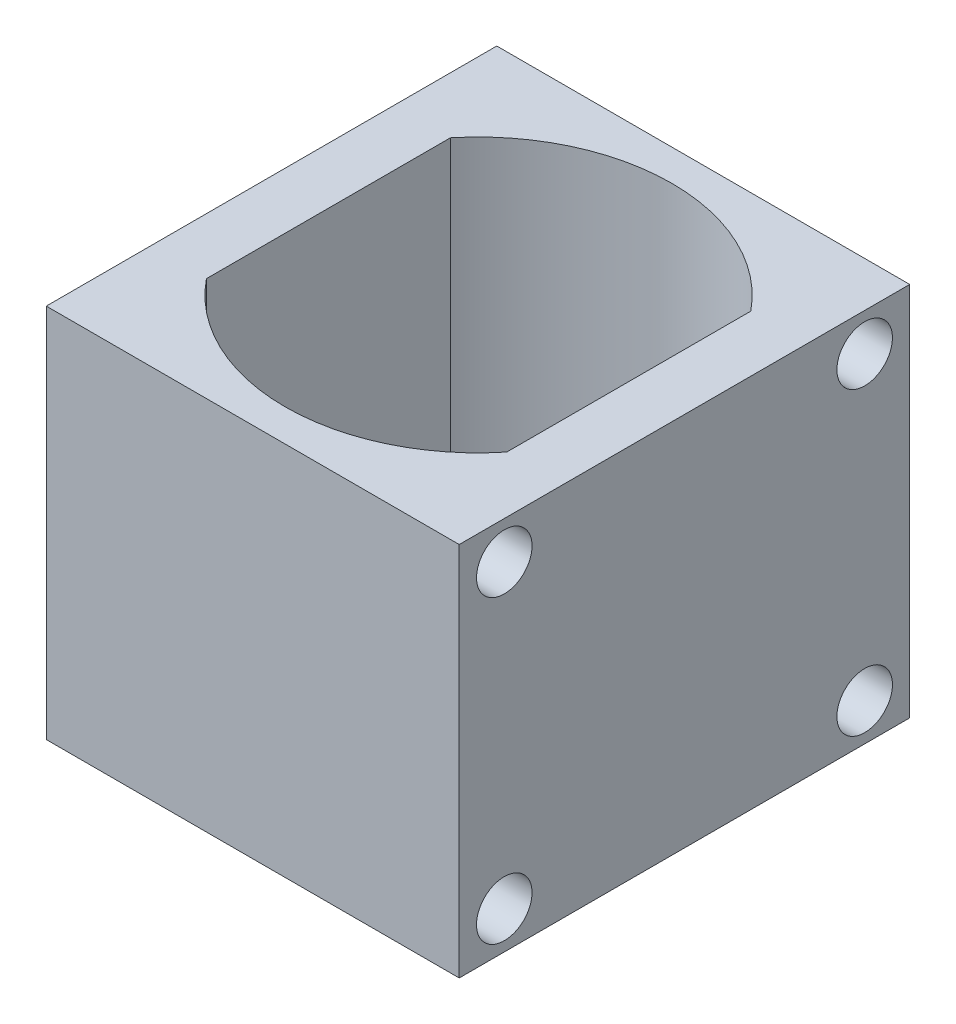
ISO-10303-21;
HEADER;
FILE_DESCRIPTION(('STEP AP214'),'2;1');
FILE_NAME('part.step','',(''),(''),'','','');
FILE_SCHEMA(('AUTOMOTIVE_DESIGN { 1 0 10303 214 1 1 1 1 }'));
ENDSEC;
DATA;
#1=APPLICATION_CONTEXT('core data for automotive mechanical design processes');
#2=APPLICATION_PROTOCOL_DEFINITION('international standard','automotive_design',2000,#1);
#3=PRODUCT_CONTEXT('',#1,'mechanical');
#4=PRODUCT('Part','Part','',(#3));
#5=PRODUCT_RELATED_PRODUCT_CATEGORY('part','',(#4));
#6=PRODUCT_DEFINITION_FORMATION('','',#4);
#7=PRODUCT_DEFINITION_CONTEXT('part definition',#1,'design');
#8=PRODUCT_DEFINITION('design','',#6,#7);
#9=PRODUCT_DEFINITION_SHAPE('','',#8);
#10=(LENGTH_UNIT() NAMED_UNIT(*) SI_UNIT(.MILLI.,.METRE.));
#11=(NAMED_UNIT(*) PLANE_ANGLE_UNIT() SI_UNIT($,.RADIAN.));
#12=(NAMED_UNIT(*) SI_UNIT($,.STERADIAN.) SOLID_ANGLE_UNIT());
#13=UNCERTAINTY_MEASURE_WITH_UNIT(LENGTH_MEASURE(1.E-05),#10,'distance_accuracy_value','');
#14=(GEOMETRIC_REPRESENTATION_CONTEXT(3) GLOBAL_UNCERTAINTY_ASSIGNED_CONTEXT((#13)) GLOBAL_UNIT_ASSIGNED_CONTEXT((#10,
#11,#12)) REPRESENTATION_CONTEXT('',''));
#15=CARTESIAN_POINT('',(0.,0.,0.));
#16=DIRECTION('',(0.,0.,1.));
#17=DIRECTION('',(1.,0.,0.));
#18=AXIS2_PLACEMENT_3D('',#15,#16,#17);
#19=CARTESIAN_POINT('',(0.,20.,0.));
#20=DIRECTION('',(0.,-1.,0.));
#21=DIRECTION('',(0.,0.,-1.));
#22=AXIS2_PLACEMENT_3D('',#19,#20,#21);
#23=PLANE('',#22);
#24=DIRECTION('',(0.,0.,1.));
#25=VECTOR('',#24,1.);
#26=CARTESIAN_POINT('',(-11.,20.,12.));
#27=LINE('',#26,#25);
#28=CARTESIAN_POINT('',(-11.,20.,-12.));
#29=VERTEX_POINT('',#28);
#30=CARTESIAN_POINT('',(-11.,20.,12.));
#31=VERTEX_POINT('',#30);
#32=EDGE_CURVE('E159',#29,#31,#27,.T.);
#33=ORIENTED_EDGE('',*,*,#32,.T.);
#34=DIRECTION('',(1.,0.,0.));
#35=VECTOR('',#34,1.);
#36=CARTESIAN_POINT('',(11.,20.,12.));
#37=LINE('',#36,#35);
#38=CARTESIAN_POINT('',(11.,20.,12.));
#39=VERTEX_POINT('',#38);
#40=EDGE_CURVE('E163',#31,#39,#37,.T.);
#41=ORIENTED_EDGE('',*,*,#40,.T.);
#42=DIRECTION('',(0.,0.,-1.));
#43=VECTOR('',#42,1.);
#44=CARTESIAN_POINT('',(11.,20.,-12.));
#45=LINE('',#44,#43);
#46=CARTESIAN_POINT('',(11.,20.,-12.));
#47=VERTEX_POINT('',#46);
#48=EDGE_CURVE('E167',#39,#47,#45,.T.);
#49=ORIENTED_EDGE('',*,*,#48,.T.);
#50=DIRECTION('',(-1.,0.,0.));
#51=VECTOR('',#50,1.);
#52=CARTESIAN_POINT('',(-11.,20.,-12.));
#53=LINE('',#52,#51);
#54=EDGE_CURVE('E170',#47,#29,#53,.T.);
#55=ORIENTED_EDGE('',*,*,#54,.T.);
#56=EDGE_LOOP('',(#33,#41,#49,#55));
#57=FACE_BOUND('',#56,.T.);
#58=CARTESIAN_POINT('',(0.,20.,0.));
#59=DIRECTION('',(0.,1.,0.));
#60=DIRECTION('',(0.,0.,-1.));
#61=AXIS2_PLACEMENT_3D('',#58,#59,#60);
#62=CIRCLE('',#61,10.3282894508827);
#63=CARTESIAN_POINT('',(7.99999999999999,20.,-6.53250051520967));
#64=VERTEX_POINT('',#63);
#65=CARTESIAN_POINT('',(-8.,20.,-6.53250051520967));
#66=VERTEX_POINT('',#65);
#67=EDGE_CURVE('E109',#64,#66,#62,.T.);
#68=ORIENTED_EDGE('',*,*,#67,.F.);
#69=DIRECTION('',(0.,0.,-1.));
#70=VECTOR('',#69,1.);
#71=CARTESIAN_POINT('',(7.99999999999999,20.,-6.53250051520967));
#72=LINE('',#71,#70);
#73=CARTESIAN_POINT('',(7.99999999999999,20.,6.46749948479033));
#74=VERTEX_POINT('',#73);
#75=EDGE_CURVE('E135',#74,#64,#72,.T.);
#76=ORIENTED_EDGE('',*,*,#75,.F.);
#77=CARTESIAN_POINT('',(0.,20.,0.));
#78=DIRECTION('',(0.,1.,0.));
#79=DIRECTION('',(0.,0.,1.));
#80=AXIS2_PLACEMENT_3D('',#77,#78,#79);
#81=CIRCLE('',#80,10.2873004032041);
#82=CARTESIAN_POINT('',(-8.,20.,6.46749948479033));
#83=VERTEX_POINT('',#82);
#84=EDGE_CURVE('E131',#83,#74,#81,.T.);
#85=ORIENTED_EDGE('',*,*,#84,.F.);
#86=DIRECTION('',(0.,0.,1.));
#87=VECTOR('',#86,1.);
#88=CARTESIAN_POINT('',(-8.,20.,-6.53250051520967));
#89=LINE('',#88,#87);
#90=EDGE_CURVE('E118',#66,#83,#89,.T.);
#91=ORIENTED_EDGE('',*,*,#90,.F.);
#92=EDGE_LOOP('',(#68,#76,#85,#91));
#93=FACE_BOUND('',#92,.T.);
#94=ADVANCED_FACE('F43',(#57,#93),#23,.F.);
#95=CARTESIAN_POINT('',(0.,0.,0.));
#96=DIRECTION('',(0.,-1.,0.));
#97=DIRECTION('',(0.,0.,-1.));
#98=AXIS2_PLACEMENT_3D('',#95,#96,#97);
#99=PLANE('',#98);
#100=DIRECTION('',(1.,0.,0.));
#101=VECTOR('',#100,1.);
#102=CARTESIAN_POINT('',(11.,0.,12.));
#103=LINE('',#102,#101);
#104=CARTESIAN_POINT('',(-11.,0.,12.));
#105=VERTEX_POINT('',#104);
#106=CARTESIAN_POINT('',(11.,0.,12.));
#107=VERTEX_POINT('',#106);
#108=EDGE_CURVE('E127',#105,#107,#103,.T.);
#109=ORIENTED_EDGE('',*,*,#108,.F.);
#110=DIRECTION('',(0.,0.,1.));
#111=VECTOR('',#110,1.);
#112=CARTESIAN_POINT('',(-11.,0.,0.));
#113=LINE('',#112,#111);
#114=CARTESIAN_POINT('',(-11.,0.,-12.));
#115=VERTEX_POINT('',#114);
#116=EDGE_CURVE('E164',#115,#105,#113,.T.);
#117=ORIENTED_EDGE('',*,*,#116,.F.);
#118=DIRECTION('',(-1.,0.,0.));
#119=VECTOR('',#118,1.);
#120=CARTESIAN_POINT('',(-11.,0.,-12.));
#121=LINE('',#120,#119);
#122=CARTESIAN_POINT('',(11.,0.,-12.));
#123=VERTEX_POINT('',#122);
#124=EDGE_CURVE('E180',#123,#115,#121,.T.);
#125=ORIENTED_EDGE('',*,*,#124,.F.);
#126=DIRECTION('',(0.,0.,-1.));
#127=VECTOR('',#126,1.);
#128=CARTESIAN_POINT('',(11.,0.,-12.));
#129=LINE('',#128,#127);
#130=EDGE_CURVE('E177',#107,#123,#129,.T.);
#131=ORIENTED_EDGE('',*,*,#130,.F.);
#132=EDGE_LOOP('',(#109,#117,#125,#131));
#133=FACE_BOUND('',#132,.T.);
#134=DIRECTION('',(0.,0.,-1.));
#135=VECTOR('',#134,1.);
#136=CARTESIAN_POINT('',(7.99999999999999,0.,-6.53250051520967));
#137=LINE('',#136,#135);
#138=CARTESIAN_POINT('',(7.99999999999999,0.,6.46749948479033));
#139=VERTEX_POINT('',#138);
#140=CARTESIAN_POINT('',(7.99999999999999,0.,-6.53250051520967));
#141=VERTEX_POINT('',#140);
#142=EDGE_CURVE('E119',#139,#141,#137,.T.);
#143=ORIENTED_EDGE('',*,*,#142,.T.);
#144=CARTESIAN_POINT('',(0.,0.,0.));
#145=DIRECTION('',(0.,1.,0.));
#146=DIRECTION('',(0.,0.,-1.));
#147=AXIS2_PLACEMENT_3D('',#144,#145,#146);
#148=CIRCLE('',#147,10.3282894508827);
#149=CARTESIAN_POINT('',(-8.,0.,-6.53250051520967));
#150=VERTEX_POINT('',#149);
#151=EDGE_CURVE('E67',#141,#150,#148,.T.);
#152=ORIENTED_EDGE('',*,*,#151,.T.);
#153=DIRECTION('',(0.,0.,1.));
#154=VECTOR('',#153,1.);
#155=CARTESIAN_POINT('',(-8.,0.,-6.53250051520967));
#156=LINE('',#155,#154);
#157=CARTESIAN_POINT('',(-8.,0.,6.46749948479033));
#158=VERTEX_POINT('',#157);
#159=EDGE_CURVE('E125',#150,#158,#156,.T.);
#160=ORIENTED_EDGE('',*,*,#159,.T.);
#161=CARTESIAN_POINT('',(0.,0.,0.));
#162=DIRECTION('',(0.,1.,0.));
#163=DIRECTION('',(0.,0.,1.));
#164=AXIS2_PLACEMENT_3D('',#161,#162,#163);
#165=CIRCLE('',#164,10.2873004032041);
#166=EDGE_CURVE('E146',#158,#139,#165,.T.);
#167=ORIENTED_EDGE('',*,*,#166,.T.);
#168=EDGE_LOOP('',(#143,#152,#160,#167));
#169=FACE_BOUND('',#168,.T.);
#170=ADVANCED_FACE('F203',(#133,#169),#99,.T.);
#171=CARTESIAN_POINT('',(11.,20.,12.));
#172=DIRECTION('',(0.,0.,-1.));
#173=DIRECTION('',(-1.,0.,0.));
#174=AXIS2_PLACEMENT_3D('',#171,#172,#173);
#175=PLANE('',#174);
#176=ORIENTED_EDGE('',*,*,#108,.T.);
#177=DIRECTION('',(0.,-1.,0.));
#178=VECTOR('',#177,1.);
#179=CARTESIAN_POINT('',(11.,20.,12.));
#180=LINE('',#179,#178);
#181=EDGE_CURVE('E52',#39,#107,#180,.T.);
#182=ORIENTED_EDGE('',*,*,#181,.F.);
#183=ORIENTED_EDGE('',*,*,#40,.F.);
#184=DIRECTION('',(0.,-1.,0.));
#185=VECTOR('',#184,1.);
#186=CARTESIAN_POINT('',(-11.,20.,12.));
#187=LINE('',#186,#185);
#188=EDGE_CURVE('E11',#31,#105,#187,.T.);
#189=ORIENTED_EDGE('',*,*,#188,.T.);
#190=EDGE_LOOP('',(#176,#182,#183,#189));
#191=FACE_BOUND('',#190,.T.);
#192=ADVANCED_FACE('F45',(#191),#175,.F.);
#193=CARTESIAN_POINT('',(11.,20.,-12.));
#194=DIRECTION('',(-1.,0.,0.));
#195=DIRECTION('',(0.,0.,1.));
#196=AXIS2_PLACEMENT_3D('',#193,#194,#195);
#197=PLANE('',#196);
#198=CARTESIAN_POINT('',(11.,2.,9.6));
#199=DIRECTION('',(1.,0.,0.));
#200=DIRECTION('',(0.,0.,1.));
#201=AXIS2_PLACEMENT_3D('',#198,#199,#200);
#202=CIRCLE('',#201,1.48);
#203=CARTESIAN_POINT('',(11.,2.,11.08));
#204=VERTEX_POINT('',#203);
#205=EDGE_CURVE('E419',#204,#204,#202,.T.);
#206=ORIENTED_EDGE('',*,*,#205,.F.);
#207=EDGE_LOOP('',(#206));
#208=FACE_BOUND('',#207,.T.);
#209=CARTESIAN_POINT('',(11.,2.,-9.6));
#210=DIRECTION('',(1.,0.,0.));
#211=DIRECTION('',(0.,0.,-1.));
#212=AXIS2_PLACEMENT_3D('',#209,#210,#211);
#213=CIRCLE('',#212,1.48);
#214=CARTESIAN_POINT('',(11.,2.,-11.08));
#215=VERTEX_POINT('',#214);
#216=EDGE_CURVE('E443',#215,#215,#213,.T.);
#217=ORIENTED_EDGE('',*,*,#216,.F.);
#218=EDGE_LOOP('',(#217));
#219=FACE_BOUND('',#218,.T.);
#220=CARTESIAN_POINT('',(11.,18.,-9.6));
#221=DIRECTION('',(1.,0.,0.));
#222=DIRECTION('',(0.,0.,1.));
#223=AXIS2_PLACEMENT_3D('',#220,#221,#222);
#224=CIRCLE('',#223,1.48);
#225=CARTESIAN_POINT('',(11.,18.,-8.12));
#226=VERTEX_POINT('',#225);
#227=EDGE_CURVE('E432',#226,#226,#224,.T.);
#228=ORIENTED_EDGE('',*,*,#227,.F.);
#229=EDGE_LOOP('',(#228));
#230=FACE_BOUND('',#229,.T.);
#231=CARTESIAN_POINT('',(11.,18.,9.6));
#232=DIRECTION('',(1.,0.,0.));
#233=DIRECTION('',(0.,0.,-1.));
#234=AXIS2_PLACEMENT_3D('',#231,#232,#233);
#235=CIRCLE('',#234,1.48);
#236=CARTESIAN_POINT('',(11.,18.,8.12));
#237=VERTEX_POINT('',#236);
#238=EDGE_CURVE('E429',#237,#237,#235,.T.);
#239=ORIENTED_EDGE('',*,*,#238,.F.);
#240=EDGE_LOOP('',(#239));
#241=FACE_BOUND('',#240,.T.);
#242=ORIENTED_EDGE('',*,*,#130,.T.);
#243=DIRECTION('',(0.,-1.,0.));
#244=VECTOR('',#243,1.);
#245=CARTESIAN_POINT('',(11.,20.,-12.));
#246=LINE('',#245,#244);
#247=EDGE_CURVE('E188',#47,#123,#246,.T.);
#248=ORIENTED_EDGE('',*,*,#247,.F.);
#249=ORIENTED_EDGE('',*,*,#48,.F.);
#250=ORIENTED_EDGE('',*,*,#181,.T.);
#251=EDGE_LOOP('',(#242,#248,#249,#250));
#252=FACE_BOUND('',#251,.T.);
#253=ADVANCED_FACE('F197',(#208,#219,#230,#241,#252),#197,.F.);
#254=CARTESIAN_POINT('',(-11.,20.,-12.));
#255=DIRECTION('',(0.,0.,1.));
#256=DIRECTION('',(1.,0.,0.));
#257=AXIS2_PLACEMENT_3D('',#254,#255,#256);
#258=PLANE('',#257);
#259=ORIENTED_EDGE('',*,*,#124,.T.);
#260=DIRECTION('',(0.,-1.,0.));
#261=VECTOR('',#260,1.);
#262=CARTESIAN_POINT('',(-11.,20.,-12.));
#263=LINE('',#262,#261);
#264=EDGE_CURVE('E174',#29,#115,#263,.T.);
#265=ORIENTED_EDGE('',*,*,#264,.F.);
#266=ORIENTED_EDGE('',*,*,#54,.F.);
#267=ORIENTED_EDGE('',*,*,#247,.T.);
#268=EDGE_LOOP('',(#259,#265,#266,#267));
#269=FACE_BOUND('',#268,.T.);
#270=ADVANCED_FACE('F208',(#269),#258,.F.);
#271=CARTESIAN_POINT('',(-11.,20.,0.));
#272=DIRECTION('',(1.,0.,0.));
#273=DIRECTION('',(0.,0.,-1.));
#274=AXIS2_PLACEMENT_3D('',#271,#272,#273);
#275=PLANE('',#274);
#276=ORIENTED_EDGE('',*,*,#116,.T.);
#277=ORIENTED_EDGE('',*,*,#188,.F.);
#278=ORIENTED_EDGE('',*,*,#32,.F.);
#279=ORIENTED_EDGE('',*,*,#264,.T.);
#280=EDGE_LOOP('',(#276,#277,#278,#279));
#281=FACE_BOUND('',#280,.T.);
#282=ADVANCED_FACE('F211',(#281),#275,.F.);
#283=CARTESIAN_POINT('',(0.,20.,0.));
#284=DIRECTION('',(0.,-1.,0.));
#285=DIRECTION('',(0.,0.,-1.));
#286=AXIS2_PLACEMENT_3D('',#283,#284,#285);
#287=CYLINDRICAL_SURFACE('',#286,10.3282894508827);
#288=ORIENTED_EDGE('',*,*,#151,.F.);
#289=DIRECTION('',(0.,-1.,0.));
#290=VECTOR('',#289,1.);
#291=CARTESIAN_POINT('',(7.99999999999999,20.,-6.53250051520967));
#292=LINE('',#291,#290);
#293=EDGE_CURVE('E113',#64,#141,#292,.T.);
#294=ORIENTED_EDGE('',*,*,#293,.F.);
#295=ORIENTED_EDGE('',*,*,#67,.T.);
#296=DIRECTION('',(0.,-1.,0.));
#297=VECTOR('',#296,1.);
#298=CARTESIAN_POINT('',(-8.,20.,-6.53250051520967));
#299=LINE('',#298,#297);
#300=EDGE_CURVE('E112',#66,#150,#299,.T.);
#301=ORIENTED_EDGE('',*,*,#300,.T.);
#302=EDGE_LOOP('',(#288,#294,#295,#301));
#303=FACE_BOUND('',#302,.T.);
#304=ADVANCED_FACE('F111',(#303),#287,.F.);
#305=CARTESIAN_POINT('',(-8.,20.,-6.53250051520967));
#306=DIRECTION('',(1.,0.,0.));
#307=DIRECTION('',(0.,0.,-1.));
#308=AXIS2_PLACEMENT_3D('',#305,#306,#307);
#309=PLANE('',#308);
#310=ORIENTED_EDGE('',*,*,#159,.F.);
#311=ORIENTED_EDGE('',*,*,#300,.F.);
#312=ORIENTED_EDGE('',*,*,#90,.T.);
#313=DIRECTION('',(0.,-1.,0.));
#314=VECTOR('',#313,1.);
#315=CARTESIAN_POINT('',(-8.,20.,6.46749948479033));
#316=LINE('',#315,#314);
#317=EDGE_CURVE('E128',#83,#158,#316,.T.);
#318=ORIENTED_EDGE('',*,*,#317,.T.);
#319=EDGE_LOOP('',(#310,#311,#312,#318));
#320=FACE_BOUND('',#319,.T.);
#321=ADVANCED_FACE('F122',(#320),#309,.T.);
#322=CARTESIAN_POINT('',(0.,20.,0.));
#323=DIRECTION('',(0.,-1.,0.));
#324=DIRECTION('',(0.,0.,-1.));
#325=AXIS2_PLACEMENT_3D('',#322,#323,#324);
#326=CYLINDRICAL_SURFACE('',#325,10.2873004032041);
#327=ORIENTED_EDGE('',*,*,#166,.F.);
#328=ORIENTED_EDGE('',*,*,#317,.F.);
#329=ORIENTED_EDGE('',*,*,#84,.T.);
#330=DIRECTION('',(0.,-1.,0.));
#331=VECTOR('',#330,1.);
#332=CARTESIAN_POINT('',(7.99999999999999,20.,6.46749948479033));
#333=LINE('',#332,#331);
#334=EDGE_CURVE('E59',#74,#139,#333,.T.);
#335=ORIENTED_EDGE('',*,*,#334,.T.);
#336=EDGE_LOOP('',(#327,#328,#329,#335));
#337=FACE_BOUND('',#336,.T.);
#338=ADVANCED_FACE('F250',(#337),#326,.F.);
#339=CARTESIAN_POINT('',(7.99999999999999,20.,-6.53250051520967));
#340=DIRECTION('',(-1.,0.,0.));
#341=DIRECTION('',(0.,0.,1.));
#342=AXIS2_PLACEMENT_3D('',#339,#340,#341);
#343=PLANE('',#342);
#344=ORIENTED_EDGE('',*,*,#142,.F.);
#345=ORIENTED_EDGE('',*,*,#334,.F.);
#346=ORIENTED_EDGE('',*,*,#75,.T.);
#347=ORIENTED_EDGE('',*,*,#293,.T.);
#348=EDGE_LOOP('',(#344,#345,#346,#347));
#349=FACE_BOUND('',#348,.T.);
#350=ADVANCED_FACE('F256',(#349),#343,.T.);
#351=CARTESIAN_POINT('',(8.,18.,9.6));
#352=DIRECTION('',(1.,0.,0.));
#353=DIRECTION('',(0.,0.,-1.));
#354=AXIS2_PLACEMENT_3D('',#351,#352,#353);
#355=CYLINDRICAL_SURFACE('',#354,1.48);
#356=CARTESIAN_POINT('',(8.,18.,9.6));
#357=DIRECTION('',(1.,0.,0.));
#358=DIRECTION('',(0.,0.,-1.));
#359=AXIS2_PLACEMENT_3D('',#356,#357,#358);
#360=CIRCLE('',#359,1.48);
#361=CARTESIAN_POINT('',(8.,18.,8.12));
#362=VERTEX_POINT('',#361);
#363=EDGE_CURVE('E143',#362,#362,#360,.T.);
#364=ORIENTED_EDGE('',*,*,#363,.F.);
#365=EDGE_LOOP('',(#364));
#366=FACE_BOUND('',#365,.T.);
#367=ORIENTED_EDGE('',*,*,#238,.T.);
#368=EDGE_LOOP('',(#367));
#369=FACE_BOUND('',#368,.T.);
#370=ADVANCED_FACE('F264',(#366,#369),#355,.F.);
#371=CARTESIAN_POINT('',(8.,18.,9.6));
#372=DIRECTION('',(1.,0.,0.));
#373=DIRECTION('',(0.,0.,-1.));
#374=AXIS2_PLACEMENT_3D('',#371,#372,#373);
#375=PLANE('',#374);
#376=ORIENTED_EDGE('',*,*,#363,.T.);
#377=EDGE_LOOP('',(#376));
#378=FACE_BOUND('',#377,.T.);
#379=ADVANCED_FACE('F271',(#378),#375,.T.);
#380=CARTESIAN_POINT('',(8.,18.,-9.6));
#381=DIRECTION('',(1.,0.,0.));
#382=DIRECTION('',(0.,0.,-1.));
#383=AXIS2_PLACEMENT_3D('',#380,#381,#382);
#384=CYLINDRICAL_SURFACE('',#383,1.48);
#385=CARTESIAN_POINT('',(8.,18.,-9.6));
#386=DIRECTION('',(1.,0.,0.));
#387=DIRECTION('',(0.,0.,1.));
#388=AXIS2_PLACEMENT_3D('',#385,#386,#387);
#389=CIRCLE('',#388,1.48);
#390=CARTESIAN_POINT('',(8.,18.,-8.12));
#391=VERTEX_POINT('',#390);
#392=EDGE_CURVE('E437',#391,#391,#389,.T.);
#393=ORIENTED_EDGE('',*,*,#392,.F.);
#394=EDGE_LOOP('',(#393));
#395=FACE_BOUND('',#394,.T.);
#396=ORIENTED_EDGE('',*,*,#227,.T.);
#397=EDGE_LOOP('',(#396));
#398=FACE_BOUND('',#397,.T.);
#399=ADVANCED_FACE('F279',(#395,#398),#384,.F.);
#400=CARTESIAN_POINT('',(8.,18.,-9.6));
#401=DIRECTION('',(-1.,0.,0.));
#402=DIRECTION('',(0.,0.,1.));
#403=AXIS2_PLACEMENT_3D('',#400,#401,#402);
#404=PLANE('',#403);
#405=ORIENTED_EDGE('',*,*,#392,.T.);
#406=EDGE_LOOP('',(#405));
#407=FACE_BOUND('',#406,.T.);
#408=ADVANCED_FACE('F287',(#407),#404,.F.);
#409=CARTESIAN_POINT('',(8.,2.,-9.6));
#410=DIRECTION('',(1.,0.,0.));
#411=DIRECTION('',(0.,0.,-1.));
#412=AXIS2_PLACEMENT_3D('',#409,#410,#411);
#413=CYLINDRICAL_SURFACE('',#412,1.48);
#414=CARTESIAN_POINT('',(8.,2.,-9.6));
#415=DIRECTION('',(1.,0.,0.));
#416=DIRECTION('',(0.,0.,-1.));
#417=AXIS2_PLACEMENT_3D('',#414,#415,#416);
#418=CIRCLE('',#417,1.48);
#419=CARTESIAN_POINT('',(8.,2.,-11.08));
#420=VERTEX_POINT('',#419);
#421=EDGE_CURVE('E423',#420,#420,#418,.T.);
#422=ORIENTED_EDGE('',*,*,#421,.F.);
#423=EDGE_LOOP('',(#422));
#424=FACE_BOUND('',#423,.T.);
#425=ORIENTED_EDGE('',*,*,#216,.T.);
#426=EDGE_LOOP('',(#425));
#427=FACE_BOUND('',#426,.T.);
#428=ADVANCED_FACE('F295',(#424,#427),#413,.F.);
#429=CARTESIAN_POINT('',(8.,2.,-9.6));
#430=DIRECTION('',(1.,0.,0.));
#431=DIRECTION('',(0.,0.,-1.));
#432=AXIS2_PLACEMENT_3D('',#429,#430,#431);
#433=PLANE('',#432);
#434=ORIENTED_EDGE('',*,*,#421,.T.);
#435=EDGE_LOOP('',(#434));
#436=FACE_BOUND('',#435,.T.);
#437=ADVANCED_FACE('F303',(#436),#433,.T.);
#438=CARTESIAN_POINT('',(8.,2.,9.6));
#439=DIRECTION('',(1.,0.,0.));
#440=DIRECTION('',(0.,0.,-1.));
#441=AXIS2_PLACEMENT_3D('',#438,#439,#440);
#442=CYLINDRICAL_SURFACE('',#441,1.48);
#443=CARTESIAN_POINT('',(8.,2.,9.6));
#444=DIRECTION('',(1.,0.,0.));
#445=DIRECTION('',(0.,0.,1.));
#446=AXIS2_PLACEMENT_3D('',#443,#444,#445);
#447=CIRCLE('',#446,1.48);
#448=CARTESIAN_POINT('',(8.,2.,11.08));
#449=VERTEX_POINT('',#448);
#450=EDGE_CURVE('E417',#449,#449,#447,.T.);
#451=ORIENTED_EDGE('',*,*,#450,.F.);
#452=EDGE_LOOP('',(#451));
#453=FACE_BOUND('',#452,.T.);
#454=ORIENTED_EDGE('',*,*,#205,.T.);
#455=EDGE_LOOP('',(#454));
#456=FACE_BOUND('',#455,.T.);
#457=ADVANCED_FACE('F311',(#453,#456),#442,.F.);
#458=CARTESIAN_POINT('',(8.,2.,9.6));
#459=DIRECTION('',(-1.,0.,0.));
#460=DIRECTION('',(0.,0.,1.));
#461=AXIS2_PLACEMENT_3D('',#458,#459,#460);
#462=PLANE('',#461);
#463=ORIENTED_EDGE('',*,*,#450,.T.);
#464=EDGE_LOOP('',(#463));
#465=FACE_BOUND('',#464,.T.);
#466=ADVANCED_FACE('F319',(#465),#462,.F.);
#467=CLOSED_SHELL('',(#94,#170,#192,#253,#270,#282,#304,#321,#338,#350,#370,#379,#399,#408,#428,
#437,#457,#466));
#468=MANIFOLD_SOLID_BREP('B2',#467);
#469=ADVANCED_BREP_SHAPE_REPRESENTATION('',(#18,#468),#14);
#470=SHAPE_DEFINITION_REPRESENTATION(#9,#469);
ENDSEC;
END-ISO-10303-21;
